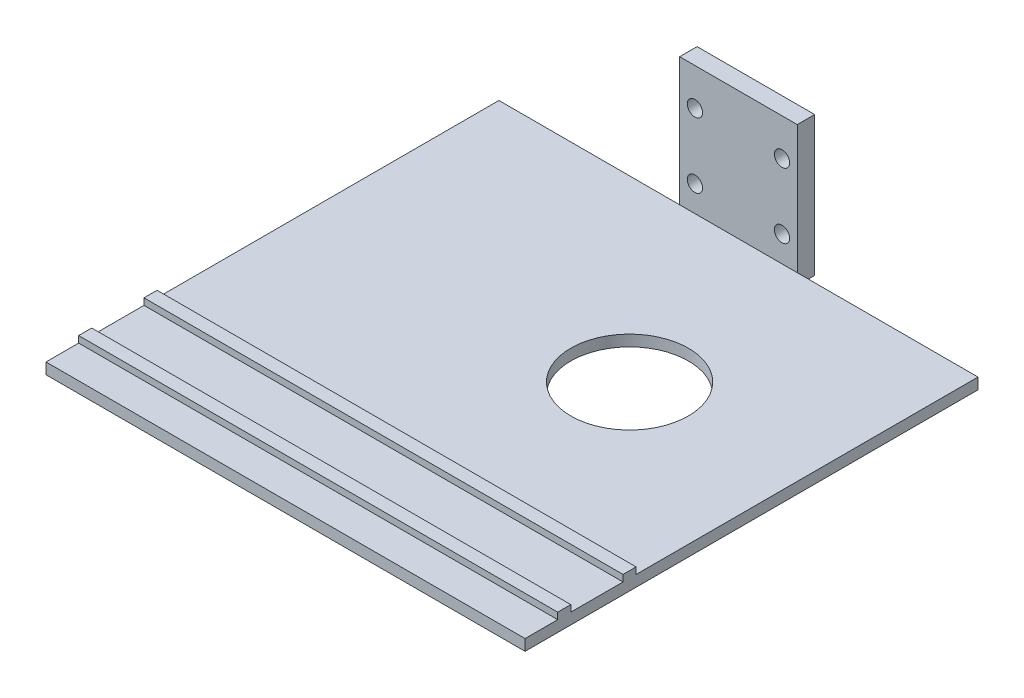
ISO-10303-21;
HEADER;
FILE_DESCRIPTION(('STEP AP214'),'2;1');
FILE_NAME('part.step','',(''),(''),'','','');
FILE_SCHEMA(('AUTOMOTIVE_DESIGN { 1 0 10303 214 1 1 1 1 }'));
ENDSEC;
DATA;
#1=APPLICATION_CONTEXT('core data for automotive mechanical design processes');
#2=APPLICATION_PROTOCOL_DEFINITION('international standard','automotive_design',2000,#1);
#3=PRODUCT_CONTEXT('',#1,'mechanical');
#4=PRODUCT('Part','Part','',(#3));
#5=PRODUCT_RELATED_PRODUCT_CATEGORY('part','',(#4));
#6=PRODUCT_DEFINITION_FORMATION('','',#4);
#7=PRODUCT_DEFINITION_CONTEXT('part definition',#1,'design');
#8=PRODUCT_DEFINITION('design','',#6,#7);
#9=PRODUCT_DEFINITION_SHAPE('','',#8);
#10=(LENGTH_UNIT() NAMED_UNIT(*) SI_UNIT(.MILLI.,.METRE.));
#11=(NAMED_UNIT(*) PLANE_ANGLE_UNIT() SI_UNIT($,.RADIAN.));
#12=(NAMED_UNIT(*) SI_UNIT($,.STERADIAN.) SOLID_ANGLE_UNIT());
#13=UNCERTAINTY_MEASURE_WITH_UNIT(LENGTH_MEASURE(1.E-05),#10,'distance_accuracy_value','');
#14=(GEOMETRIC_REPRESENTATION_CONTEXT(3) GLOBAL_UNCERTAINTY_ASSIGNED_CONTEXT((#13)) GLOBAL_UNIT_ASSIGNED_CONTEXT((#10,
#11,#12)) REPRESENTATION_CONTEXT('',''));
#15=CARTESIAN_POINT('',(0.,0.,0.));
#16=DIRECTION('',(0.,0.,1.));
#17=DIRECTION('',(1.,0.,0.));
#18=AXIS2_PLACEMENT_3D('',#15,#16,#17);
#19=CARTESIAN_POINT('',(-41.5,-33.4507406443201,4.));
#20=DIRECTION('',(0.,1.,0.));
#21=DIRECTION('',(0.,0.,1.));
#22=AXIS2_PLACEMENT_3D('',#19,#20,#21);
#23=PLANE('',#22);
#24=DIRECTION('',(-1.,0.,0.));
#25=VECTOR('',#24,1.);
#26=CARTESIAN_POINT('',(68.5,-33.4507406443201,97.5));
#27=LINE('',#26,#25);
#28=CARTESIAN_POINT('',(68.5,-33.4507406443201,97.5));
#29=VERTEX_POINT('',#28);
#30=CARTESIAN_POINT('',(-41.5,-33.4507406443201,97.5));
#31=VERTEX_POINT('',#30);
#32=EDGE_CURVE('E259',#29,#31,#27,.T.);
#33=ORIENTED_EDGE('',*,*,#32,.F.);
#34=DIRECTION('',(0.,0.,1.));
#35=VECTOR('',#34,1.);
#36=CARTESIAN_POINT('',(68.5,-33.45074064432,4.));
#37=LINE('',#36,#35);
#38=CARTESIAN_POINT('',(68.5,-33.4507406443201,85.5));
#39=VERTEX_POINT('',#38);
#40=EDGE_CURVE('E348',#39,#29,#37,.T.);
#41=ORIENTED_EDGE('',*,*,#40,.F.);
#42=DIRECTION('',(-1.,0.,0.));
#43=VECTOR('',#42,1.);
#44=CARTESIAN_POINT('',(68.5,-33.4507406443201,85.5));
#45=LINE('',#44,#43);
#46=CARTESIAN_POINT('',(-41.5,-33.4507406443201,85.5));
#47=VERTEX_POINT('',#46);
#48=EDGE_CURVE('E337',#39,#47,#45,.T.);
#49=ORIENTED_EDGE('',*,*,#48,.T.);
#50=DIRECTION('',(0.,0.,1.));
#51=VECTOR('',#50,1.);
#52=CARTESIAN_POINT('',(-41.5,-33.4507406443201,4.));
#53=LINE('',#52,#51);
#54=EDGE_CURVE('E270',#47,#31,#53,.T.);
#55=ORIENTED_EDGE('',*,*,#54,.T.);
#56=EDGE_LOOP('',(#33,#41,#49,#55));
#57=FACE_BOUND('',#56,.T.);
#58=ADVANCED_FACE('F33',(#57),#23,.T.);
#59=CARTESIAN_POINT('',(29.5,-33.4507406443201,45.));
#60=DIRECTION('',(0.,1.,0.));
#61=DIRECTION('',(0.,0.,1.));
#62=AXIS2_PLACEMENT_3D('',#59,#60,#61);
#63=CIRCLE('',#62,13.5);
#64=CARTESIAN_POINT('',(29.5,-33.4507406443201,58.5));
#65=VERTEX_POINT('',#64);
#66=EDGE_CURVE('E386',#65,#65,#63,.T.);
#67=ORIENTED_EDGE('',*,*,#66,.F.);
#68=EDGE_LOOP('',(#67));
#69=FACE_BOUND('',#68,.T.);
#70=DIRECTION('',(-1.,0.,0.));
#71=VECTOR('',#70,1.);
#72=CARTESIAN_POINT('',(68.5,-33.4507406443201,82.5));
#73=LINE('',#72,#71);
#74=CARTESIAN_POINT('',(68.5,-33.4507406443201,82.5));
#75=VERTEX_POINT('',#74);
#76=CARTESIAN_POINT('',(-41.5,-33.4507406443201,82.5));
#77=VERTEX_POINT('',#76);
#78=EDGE_CURVE('E340',#75,#77,#73,.T.);
#79=ORIENTED_EDGE('',*,*,#78,.F.);
#80=CARTESIAN_POINT('',(68.5,-33.45074064432,4.));
#81=VERTEX_POINT('',#80);
#82=EDGE_CURVE('E344',#81,#75,#37,.T.);
#83=ORIENTED_EDGE('',*,*,#82,.F.);
#84=DIRECTION('',(1.,0.,0.));
#85=VECTOR('',#84,1.);
#86=CARTESIAN_POINT('',(-41.5,-33.4507406443201,4.));
#87=LINE('',#86,#85);
#88=CARTESIAN_POINT('',(27.,-33.45074064432,4.));
#89=VERTEX_POINT('',#88);
#90=EDGE_CURVE('E45',#89,#81,#87,.T.);
#91=ORIENTED_EDGE('',*,*,#90,.F.);
#92=CARTESIAN_POINT('',(0.,-33.45074064432,4.));
#93=VERTEX_POINT('',#92);
#94=EDGE_CURVE('E11',#93,#89,#87,.T.);
#95=ORIENTED_EDGE('',*,*,#94,.F.);
#96=CARTESIAN_POINT('',(-41.5,-33.4507406443201,4.));
#97=VERTEX_POINT('',#96);
#98=EDGE_CURVE('E44',#97,#93,#87,.T.);
#99=ORIENTED_EDGE('',*,*,#98,.F.);
#100=EDGE_CURVE('E273',#97,#77,#53,.T.);
#101=ORIENTED_EDGE('',*,*,#100,.T.);
#102=EDGE_LOOP('',(#79,#83,#91,#95,#99,#101));
#103=FACE_BOUND('',#102,.T.);
#104=ADVANCED_FACE('F223',(#69,#103),#23,.T.);
#105=CARTESIAN_POINT('',(0.,0.,4.));
#106=DIRECTION('',(0.,0.,1.));
#107=DIRECTION('',(1.,0.,0.));
#108=AXIS2_PLACEMENT_3D('',#105,#106,#107);
#109=PLANE('',#108);
#110=DIRECTION('',(1.,0.,0.));
#111=VECTOR('',#110,1.);
#112=CARTESIAN_POINT('',(0.,-4.,4.));
#113=LINE('',#112,#111);
#114=CARTESIAN_POINT('',(0.,-4.,4.));
#115=VERTEX_POINT('',#114);
#116=CARTESIAN_POINT('',(27.,-4.,4.));
#117=VERTEX_POINT('',#116);
#118=EDGE_CURVE('E163',#115,#117,#113,.T.);
#119=ORIENTED_EDGE('',*,*,#118,.F.);
#120=DIRECTION('',(0.,-1.,0.));
#121=VECTOR('',#120,1.);
#122=CARTESIAN_POINT('',(0.,0.,4.));
#123=LINE('',#122,#121);
#124=EDGE_CURVE('E171',#115,#93,#123,.T.);
#125=ORIENTED_EDGE('',*,*,#124,.T.);
#126=ORIENTED_EDGE('',*,*,#94,.T.);
#127=DIRECTION('',(0.,1.,0.));
#128=VECTOR('',#127,1.);
#129=CARTESIAN_POINT('',(27.,0.,4.));
#130=LINE('',#129,#128);
#131=EDGE_CURVE('E305',#89,#117,#130,.T.);
#132=ORIENTED_EDGE('',*,*,#131,.T.);
#133=EDGE_LOOP('',(#119,#125,#126,#132));
#134=FACE_BOUND('',#133,.T.);
#135=CARTESIAN_POINT('',(23.5,-27.5,4.));
#136=DIRECTION('',(0.,0.,1.));
#137=DIRECTION('',(1.,0.,0.));
#138=AXIS2_PLACEMENT_3D('',#135,#136,#137);
#139=CIRCLE('',#138,1.75);
#140=CARTESIAN_POINT('',(25.25,-27.5,4.));
#141=VERTEX_POINT('',#140);
#142=EDGE_CURVE('E300',#141,#141,#139,.T.);
#143=ORIENTED_EDGE('',*,*,#142,.F.);
#144=EDGE_LOOP('',(#143));
#145=FACE_BOUND('',#144,.T.);
#146=CARTESIAN_POINT('',(3.5,-12.5,4.));
#147=DIRECTION('',(0.,0.,1.));
#148=DIRECTION('',(1.,0.,0.));
#149=AXIS2_PLACEMENT_3D('',#146,#147,#148);
#150=CIRCLE('',#149,1.75);
#151=CARTESIAN_POINT('',(5.25,-12.5,4.));
#152=VERTEX_POINT('',#151);
#153=EDGE_CURVE('E299',#152,#152,#150,.T.);
#154=ORIENTED_EDGE('',*,*,#153,.F.);
#155=EDGE_LOOP('',(#154));
#156=FACE_BOUND('',#155,.T.);
#157=CARTESIAN_POINT('',(3.5,-27.5,4.));
#158=DIRECTION('',(0.,0.,1.));
#159=DIRECTION('',(1.,0.,0.));
#160=AXIS2_PLACEMENT_3D('',#157,#158,#159);
#161=CIRCLE('',#160,1.75);
#162=CARTESIAN_POINT('',(5.25000000000001,-27.5,4.));
#163=VERTEX_POINT('',#162);
#164=EDGE_CURVE('E290',#163,#163,#161,.T.);
#165=ORIENTED_EDGE('',*,*,#164,.F.);
#166=EDGE_LOOP('',(#165));
#167=FACE_BOUND('',#166,.T.);
#168=CARTESIAN_POINT('',(23.5,-12.5,4.));
#169=DIRECTION('',(0.,0.,1.));
#170=DIRECTION('',(1.,0.,0.));
#171=AXIS2_PLACEMENT_3D('',#168,#169,#170);
#172=CIRCLE('',#171,1.75);
#173=CARTESIAN_POINT('',(25.25,-12.5,4.));
#174=VERTEX_POINT('',#173);
#175=EDGE_CURVE('E196',#174,#174,#172,.T.);
#176=ORIENTED_EDGE('',*,*,#175,.F.);
#177=EDGE_LOOP('',(#176));
#178=FACE_BOUND('',#177,.T.);
#179=ADVANCED_FACE('F231',(#134,#145,#156,#167,#178),#109,.T.);
#180=CARTESIAN_POINT('',(0.,0.,4.));
#181=DIRECTION('',(1.,0.,0.));
#182=DIRECTION('',(0.,1.,0.));
#183=AXIS2_PLACEMENT_3D('',#180,#181,#182);
#184=PLANE('',#183);
#185=ORIENTED_EDGE('',*,*,#124,.F.);
#186=DIRECTION('',(0.,0.,1.));
#187=VECTOR('',#186,1.);
#188=CARTESIAN_POINT('',(0.,-4.,0.));
#189=LINE('',#188,#187);
#190=CARTESIAN_POINT('',(0.,-4.,0.));
#191=VERTEX_POINT('',#190);
#192=EDGE_CURVE('E157',#191,#115,#189,.T.);
#193=ORIENTED_EDGE('',*,*,#192,.F.);
#194=DIRECTION('',(0.,-1.,0.));
#195=VECTOR('',#194,1.);
#196=CARTESIAN_POINT('',(0.,0.,0.));
#197=LINE('',#196,#195);
#198=CARTESIAN_POINT('',(0.,-36.,0.));
#199=VERTEX_POINT('',#198);
#200=EDGE_CURVE('E168',#191,#199,#197,.T.);
#201=ORIENTED_EDGE('',*,*,#200,.T.);
#202=DIRECTION('',(0.,0.,-1.));
#203=VECTOR('',#202,1.);
#204=CARTESIAN_POINT('',(0.,-36.,4.));
#205=LINE('',#204,#203);
#206=CARTESIAN_POINT('',(0.,-36.,4.));
#207=VERTEX_POINT('',#206);
#208=EDGE_CURVE('E42',#207,#199,#205,.T.);
#209=ORIENTED_EDGE('',*,*,#208,.F.);
#210=EDGE_CURVE('E187',#93,#207,#123,.T.);
#211=ORIENTED_EDGE('',*,*,#210,.F.);
#212=EDGE_LOOP('',(#185,#193,#201,#209,#211));
#213=FACE_BOUND('',#212,.T.);
#214=ADVANCED_FACE('F35',(#213),#184,.F.);
#215=CARTESIAN_POINT('',(0.,-36.,4.));
#216=DIRECTION('',(0.,1.,0.));
#217=DIRECTION('',(0.,0.,1.));
#218=AXIS2_PLACEMENT_3D('',#215,#216,#217);
#219=PLANE('',#218);
#220=CARTESIAN_POINT('',(29.5,-36.,45.));
#221=DIRECTION('',(0.,1.,0.));
#222=DIRECTION('',(0.,0.,1.));
#223=AXIS2_PLACEMENT_3D('',#220,#221,#222);
#224=CIRCLE('',#223,13.5);
#225=CARTESIAN_POINT('',(29.5,-36.,58.5));
#226=VERTEX_POINT('',#225);
#227=EDGE_CURVE('E37',#226,#226,#224,.T.);
#228=ORIENTED_EDGE('',*,*,#227,.T.);
#229=EDGE_LOOP('',(#228));
#230=FACE_BOUND('',#229,.T.);
#231=DIRECTION('',(1.,0.,0.));
#232=VECTOR('',#231,1.);
#233=CARTESIAN_POINT('',(0.,-36.,0.));
#234=LINE('',#233,#232);
#235=CARTESIAN_POINT('',(27.,-36.,0.));
#236=VERTEX_POINT('',#235);
#237=EDGE_CURVE('E174',#199,#236,#234,.T.);
#238=ORIENTED_EDGE('',*,*,#237,.T.);
#239=DIRECTION('',(0.,0.,-1.));
#240=VECTOR('',#239,1.);
#241=CARTESIAN_POINT('',(27.,-36.,4.));
#242=LINE('',#241,#240);
#243=CARTESIAN_POINT('',(27.,-36.,4.));
#244=VERTEX_POINT('',#243);
#245=EDGE_CURVE('E188',#244,#236,#242,.T.);
#246=ORIENTED_EDGE('',*,*,#245,.F.);
#247=DIRECTION('',(1.,0.,0.));
#248=VECTOR('',#247,1.);
#249=CARTESIAN_POINT('',(-41.5,-36.,4.));
#250=LINE('',#249,#248);
#251=CARTESIAN_POINT('',(68.5,-36.,4.));
#252=VERTEX_POINT('',#251);
#253=EDGE_CURVE('E291',#244,#252,#250,.T.);
#254=ORIENTED_EDGE('',*,*,#253,.T.);
#255=DIRECTION('',(0.,0.,-1.));
#256=VECTOR('',#255,1.);
#257=CARTESIAN_POINT('',(68.5,-36.,4.));
#258=LINE('',#257,#256);
#259=CARTESIAN_POINT('',(68.5,-36.,108.));
#260=VERTEX_POINT('',#259);
#261=EDGE_CURVE('E276',#260,#252,#258,.T.);
#262=ORIENTED_EDGE('',*,*,#261,.F.);
#263=DIRECTION('',(1.,0.,0.));
#264=VECTOR('',#263,1.);
#265=CARTESIAN_POINT('',(-41.5,-36.,108.));
#266=LINE('',#265,#264);
#267=CARTESIAN_POINT('',(-41.5,-36.,108.));
#268=VERTEX_POINT('',#267);
#269=EDGE_CURVE('E292',#268,#260,#266,.T.);
#270=ORIENTED_EDGE('',*,*,#269,.F.);
#271=DIRECTION('',(0.,0.,-1.));
#272=VECTOR('',#271,1.);
#273=CARTESIAN_POINT('',(-41.5,-36.,4.));
#274=LINE('',#273,#272);
#275=CARTESIAN_POINT('',(-41.5,-36.,4.));
#276=VERTEX_POINT('',#275);
#277=EDGE_CURVE('E283',#268,#276,#274,.T.);
#278=ORIENTED_EDGE('',*,*,#277,.T.);
#279=EDGE_CURVE('E287',#276,#207,#250,.T.);
#280=ORIENTED_EDGE('',*,*,#279,.T.);
#281=ORIENTED_EDGE('',*,*,#208,.T.);
#282=EDGE_LOOP('',(#238,#246,#254,#262,#270,#278,#280,#281));
#283=FACE_BOUND('',#282,.T.);
#284=ADVANCED_FACE('F311',(#230,#283),#219,.F.);
#285=CARTESIAN_POINT('',(27.,0.,4.));
#286=DIRECTION('',(-1.,0.,0.));
#287=DIRECTION('',(0.,-1.,0.));
#288=AXIS2_PLACEMENT_3D('',#285,#286,#287);
#289=PLANE('',#288);
#290=DIRECTION('',(0.,1.,0.));
#291=VECTOR('',#290,1.);
#292=CARTESIAN_POINT('',(27.,0.,0.));
#293=LINE('',#292,#291);
#294=CARTESIAN_POINT('',(27.,-4.,0.));
#295=VERTEX_POINT('',#294);
#296=EDGE_CURVE('E178',#236,#295,#293,.T.);
#297=ORIENTED_EDGE('',*,*,#296,.T.);
#298=DIRECTION('',(0.,0.,1.));
#299=VECTOR('',#298,1.);
#300=CARTESIAN_POINT('',(27.,-4.,0.));
#301=LINE('',#300,#299);
#302=EDGE_CURVE('E52',#295,#117,#301,.T.);
#303=ORIENTED_EDGE('',*,*,#302,.T.);
#304=ORIENTED_EDGE('',*,*,#131,.F.);
#305=EDGE_CURVE('E183',#244,#89,#130,.T.);
#306=ORIENTED_EDGE('',*,*,#305,.F.);
#307=ORIENTED_EDGE('',*,*,#245,.T.);
#308=EDGE_LOOP('',(#297,#303,#304,#306,#307));
#309=FACE_BOUND('',#308,.T.);
#310=ADVANCED_FACE('F472',(#309),#289,.F.);
#311=CARTESIAN_POINT('',(0.,0.,0.));
#312=DIRECTION('',(0.,0.,1.));
#313=DIRECTION('',(1.,0.,0.));
#314=AXIS2_PLACEMENT_3D('',#311,#312,#313);
#315=PLANE('',#314);
#316=CARTESIAN_POINT('',(23.5,-27.5,0.));
#317=DIRECTION('',(0.,0.,1.));
#318=DIRECTION('',(1.,0.,0.));
#319=AXIS2_PLACEMENT_3D('',#316,#317,#318);
#320=CIRCLE('',#319,1.75);
#321=CARTESIAN_POINT('',(25.25,-27.5,0.));
#322=VERTEX_POINT('',#321);
#323=EDGE_CURVE('E176',#322,#322,#320,.T.);
#324=ORIENTED_EDGE('',*,*,#323,.T.);
#325=EDGE_LOOP('',(#324));
#326=FACE_BOUND('',#325,.T.);
#327=CARTESIAN_POINT('',(3.5,-12.5,0.));
#328=DIRECTION('',(0.,0.,1.));
#329=DIRECTION('',(1.,0.,0.));
#330=AXIS2_PLACEMENT_3D('',#327,#328,#329);
#331=CIRCLE('',#330,1.75);
#332=CARTESIAN_POINT('',(5.25,-12.5,0.));
#333=VERTEX_POINT('',#332);
#334=EDGE_CURVE('E181',#333,#333,#331,.T.);
#335=ORIENTED_EDGE('',*,*,#334,.T.);
#336=EDGE_LOOP('',(#335));
#337=FACE_BOUND('',#336,.T.);
#338=CARTESIAN_POINT('',(3.5,-27.5,0.));
#339=DIRECTION('',(0.,0.,1.));
#340=DIRECTION('',(1.,0.,0.));
#341=AXIS2_PLACEMENT_3D('',#338,#339,#340);
#342=CIRCLE('',#341,1.75);
#343=CARTESIAN_POINT('',(5.25000000000001,-27.5,0.));
#344=VERTEX_POINT('',#343);
#345=EDGE_CURVE('E195',#344,#344,#342,.T.);
#346=ORIENTED_EDGE('',*,*,#345,.T.);
#347=EDGE_LOOP('',(#346));
#348=FACE_BOUND('',#347,.T.);
#349=CARTESIAN_POINT('',(23.5,-12.5,0.));
#350=DIRECTION('',(0.,0.,1.));
#351=DIRECTION('',(1.,0.,0.));
#352=AXIS2_PLACEMENT_3D('',#349,#350,#351);
#353=CIRCLE('',#352,1.75);
#354=CARTESIAN_POINT('',(25.25,-12.5,0.));
#355=VERTEX_POINT('',#354);
#356=EDGE_CURVE('E192',#355,#355,#353,.T.);
#357=ORIENTED_EDGE('',*,*,#356,.T.);
#358=EDGE_LOOP('',(#357));
#359=FACE_BOUND('',#358,.T.);
#360=ORIENTED_EDGE('',*,*,#200,.F.);
#361=DIRECTION('',(1.,0.,0.));
#362=VECTOR('',#361,1.);
#363=CARTESIAN_POINT('',(0.,-4.,0.));
#364=LINE('',#363,#362);
#365=EDGE_CURVE('E154',#191,#295,#364,.T.);
#366=ORIENTED_EDGE('',*,*,#365,.T.);
#367=ORIENTED_EDGE('',*,*,#296,.F.);
#368=ORIENTED_EDGE('',*,*,#237,.F.);
#369=EDGE_LOOP('',(#360,#366,#367,#368));
#370=FACE_BOUND('',#369,.T.);
#371=ADVANCED_FACE('F173',(#326,#337,#348,#359,#370),#315,.F.);
#372=CARTESIAN_POINT('',(23.5,-12.5,-6.));
#373=DIRECTION('',(0.,0.,1.));
#374=DIRECTION('',(1.,0.,0.));
#375=AXIS2_PLACEMENT_3D('',#372,#373,#374);
#376=CYLINDRICAL_SURFACE('',#375,1.75);
#377=ORIENTED_EDGE('',*,*,#175,.T.);
#378=EDGE_LOOP('',(#377));
#379=FACE_BOUND('',#378,.T.);
#380=ORIENTED_EDGE('',*,*,#356,.F.);
#381=EDGE_LOOP('',(#380));
#382=FACE_BOUND('',#381,.T.);
#383=ADVANCED_FACE('F217',(#379,#382),#376,.F.);
#384=CARTESIAN_POINT('',(3.5,-27.5,-6.));
#385=DIRECTION('',(0.,0.,1.));
#386=DIRECTION('',(1.,0.,0.));
#387=AXIS2_PLACEMENT_3D('',#384,#385,#386);
#388=CYLINDRICAL_SURFACE('',#387,1.75);
#389=ORIENTED_EDGE('',*,*,#164,.T.);
#390=EDGE_LOOP('',(#389));
#391=FACE_BOUND('',#390,.T.);
#392=ORIENTED_EDGE('',*,*,#345,.F.);
#393=EDGE_LOOP('',(#392));
#394=FACE_BOUND('',#393,.T.);
#395=ADVANCED_FACE('F207',(#391,#394),#388,.F.);
#396=CARTESIAN_POINT('',(3.5,-12.5,-6.));
#397=DIRECTION('',(0.,0.,1.));
#398=DIRECTION('',(1.,0.,0.));
#399=AXIS2_PLACEMENT_3D('',#396,#397,#398);
#400=CYLINDRICAL_SURFACE('',#399,1.75);
#401=ORIENTED_EDGE('',*,*,#153,.T.);
#402=EDGE_LOOP('',(#401));
#403=FACE_BOUND('',#402,.T.);
#404=ORIENTED_EDGE('',*,*,#334,.F.);
#405=EDGE_LOOP('',(#404));
#406=FACE_BOUND('',#405,.T.);
#407=ADVANCED_FACE('F204',(#403,#406),#400,.F.);
#408=CARTESIAN_POINT('',(23.5,-27.5,-6.));
#409=DIRECTION('',(0.,0.,1.));
#410=DIRECTION('',(1.,0.,0.));
#411=AXIS2_PLACEMENT_3D('',#408,#409,#410);
#412=CYLINDRICAL_SURFACE('',#411,1.75);
#413=ORIENTED_EDGE('',*,*,#142,.T.);
#414=EDGE_LOOP('',(#413));
#415=FACE_BOUND('',#414,.T.);
#416=ORIENTED_EDGE('',*,*,#323,.F.);
#417=EDGE_LOOP('',(#416));
#418=FACE_BOUND('',#417,.T.);
#419=ADVANCED_FACE('F206',(#415,#418),#412,.F.);
#420=CARTESIAN_POINT('',(-41.5,-36.,4.));
#421=DIRECTION('',(0.,0.,-1.));
#422=DIRECTION('',(-1.,0.,0.));
#423=AXIS2_PLACEMENT_3D('',#420,#421,#422);
#424=PLANE('',#423);
#425=ORIENTED_EDGE('',*,*,#98,.T.);
#426=ORIENTED_EDGE('',*,*,#210,.T.);
#427=ORIENTED_EDGE('',*,*,#279,.F.);
#428=DIRECTION('',(0.,1.,0.));
#429=VECTOR('',#428,1.);
#430=CARTESIAN_POINT('',(-41.5,-36.,4.));
#431=LINE('',#430,#429);
#432=EDGE_CURVE('E271',#276,#97,#431,.T.);
#433=ORIENTED_EDGE('',*,*,#432,.T.);
#434=EDGE_LOOP('',(#425,#426,#427,#433));
#435=FACE_BOUND('',#434,.T.);
#436=ADVANCED_FACE('F214',(#435),#424,.T.);
#437=ORIENTED_EDGE('',*,*,#253,.F.);
#438=ORIENTED_EDGE('',*,*,#305,.T.);
#439=ORIENTED_EDGE('',*,*,#90,.T.);
#440=DIRECTION('',(0.,1.,0.));
#441=VECTOR('',#440,1.);
#442=CARTESIAN_POINT('',(68.5,-36.,4.));
#443=LINE('',#442,#441);
#444=EDGE_CURVE('E334',#252,#81,#443,.T.);
#445=ORIENTED_EDGE('',*,*,#444,.F.);
#446=EDGE_LOOP('',(#437,#438,#439,#445));
#447=FACE_BOUND('',#446,.T.);
#448=ADVANCED_FACE('F247',(#447),#424,.T.);
#449=CARTESIAN_POINT('',(-41.5,-36.,108.));
#450=DIRECTION('',(0.,0.,1.));
#451=DIRECTION('',(0.,-1.,0.));
#452=AXIS2_PLACEMENT_3D('',#449,#450,#451);
#453=PLANE('',#452);
#454=ORIENTED_EDGE('',*,*,#269,.T.);
#455=DIRECTION('',(0.,-1.,0.));
#456=VECTOR('',#455,1.);
#457=CARTESIAN_POINT('',(68.5,-36.,108.));
#458=LINE('',#457,#456);
#459=CARTESIAN_POINT('',(68.5,-33.4507406443201,108.));
#460=VERTEX_POINT('',#459);
#461=EDGE_CURVE('E347',#460,#260,#458,.T.);
#462=ORIENTED_EDGE('',*,*,#461,.F.);
#463=DIRECTION('',(1.,0.,0.));
#464=VECTOR('',#463,1.);
#465=CARTESIAN_POINT('',(-41.5,-33.4507406443201,108.));
#466=LINE('',#465,#464);
#467=CARTESIAN_POINT('',(-41.5,-33.4507406443201,108.));
#468=VERTEX_POINT('',#467);
#469=EDGE_CURVE('E294',#468,#460,#466,.T.);
#470=ORIENTED_EDGE('',*,*,#469,.F.);
#471=DIRECTION('',(0.,-1.,0.));
#472=VECTOR('',#471,1.);
#473=CARTESIAN_POINT('',(-41.5,-36.,108.));
#474=LINE('',#473,#472);
#475=EDGE_CURVE('E269',#468,#268,#474,.T.);
#476=ORIENTED_EDGE('',*,*,#475,.T.);
#477=EDGE_LOOP('',(#454,#462,#470,#476));
#478=FACE_BOUND('',#477,.T.);
#479=ADVANCED_FACE('F238',(#478),#453,.T.);
#480=DIRECTION('',(-1.,0.,0.));
#481=VECTOR('',#480,1.);
#482=CARTESIAN_POINT('',(68.5,-33.4507406443201,100.5));
#483=LINE('',#482,#481);
#484=CARTESIAN_POINT('',(68.5,-33.4507406443201,100.5));
#485=VERTEX_POINT('',#484);
#486=CARTESIAN_POINT('',(-41.5,-33.4507406443201,100.5));
#487=VERTEX_POINT('',#486);
#488=EDGE_CURVE('E251',#485,#487,#483,.T.);
#489=ORIENTED_EDGE('',*,*,#488,.T.);
#490=EDGE_CURVE('E254',#487,#468,#53,.T.);
#491=ORIENTED_EDGE('',*,*,#490,.T.);
#492=ORIENTED_EDGE('',*,*,#469,.T.);
#493=EDGE_CURVE('E256',#485,#460,#37,.T.);
#494=ORIENTED_EDGE('',*,*,#493,.F.);
#495=EDGE_LOOP('',(#489,#491,#492,#494));
#496=FACE_BOUND('',#495,.T.);
#497=ADVANCED_FACE('F226',(#496),#23,.T.);
#498=CARTESIAN_POINT('',(-41.5,0.,0.));
#499=DIRECTION('',(1.,0.,0.));
#500=DIRECTION('',(0.,0.,-1.));
#501=AXIS2_PLACEMENT_3D('',#498,#499,#500);
#502=PLANE('',#501);
#503=ORIENTED_EDGE('',*,*,#432,.F.);
#504=ORIENTED_EDGE('',*,*,#277,.F.);
#505=ORIENTED_EDGE('',*,*,#475,.F.);
#506=ORIENTED_EDGE('',*,*,#490,.F.);
#507=DIRECTION('',(0.,1.,0.));
#508=VECTOR('',#507,1.);
#509=CARTESIAN_POINT('',(-41.5,-33.4507406443201,100.5));
#510=LINE('',#509,#508);
#511=CARTESIAN_POINT('',(-41.5,-31.95074064432,100.5));
#512=VERTEX_POINT('',#511);
#513=EDGE_CURVE('E265',#487,#512,#510,.T.);
#514=ORIENTED_EDGE('',*,*,#513,.T.);
#515=DIRECTION('',(0.,0.,-1.));
#516=VECTOR('',#515,1.);
#517=CARTESIAN_POINT('',(-41.5,-31.95074064432,97.5));
#518=LINE('',#517,#516);
#519=CARTESIAN_POINT('',(-41.5,-31.95074064432,97.5));
#520=VERTEX_POINT('',#519);
#521=EDGE_CURVE('E373',#512,#520,#518,.T.);
#522=ORIENTED_EDGE('',*,*,#521,.T.);
#523=DIRECTION('',(0.,-1.,0.));
#524=VECTOR('',#523,1.);
#525=CARTESIAN_POINT('',(-41.5,-33.4507406443201,97.5));
#526=LINE('',#525,#524);
#527=EDGE_CURVE('E377',#520,#31,#526,.T.);
#528=ORIENTED_EDGE('',*,*,#527,.T.);
#529=ORIENTED_EDGE('',*,*,#54,.F.);
#530=DIRECTION('',(0.,1.,0.));
#531=VECTOR('',#530,1.);
#532=CARTESIAN_POINT('',(-41.5,-33.4507406443201,85.5));
#533=LINE('',#532,#531);
#534=CARTESIAN_POINT('',(-41.5,-31.9507406443201,85.5));
#535=VERTEX_POINT('',#534);
#536=EDGE_CURVE('E321',#47,#535,#533,.T.);
#537=ORIENTED_EDGE('',*,*,#536,.T.);
#538=DIRECTION('',(0.,0.,-1.));
#539=VECTOR('',#538,1.);
#540=CARTESIAN_POINT('',(-41.5,-31.9507406443201,82.5));
#541=LINE('',#540,#539);
#542=CARTESIAN_POINT('',(-41.5,-31.9507406443201,82.5));
#543=VERTEX_POINT('',#542);
#544=EDGE_CURVE('E319',#535,#543,#541,.T.);
#545=ORIENTED_EDGE('',*,*,#544,.T.);
#546=DIRECTION('',(0.,-1.,0.));
#547=VECTOR('',#546,1.);
#548=CARTESIAN_POINT('',(-41.5,-33.4507406443201,82.5));
#549=LINE('',#548,#547);
#550=EDGE_CURVE('E316',#543,#77,#549,.T.);
#551=ORIENTED_EDGE('',*,*,#550,.T.);
#552=ORIENTED_EDGE('',*,*,#100,.F.);
#553=EDGE_LOOP('',(#503,#504,#505,#506,#514,#522,#528,#529,#537,#545,#551,#552));
#554=FACE_BOUND('',#553,.T.);
#555=ADVANCED_FACE('F237',(#554),#502,.F.);
#556=CARTESIAN_POINT('',(68.5,0.,0.));
#557=DIRECTION('',(1.,0.,0.));
#558=DIRECTION('',(0.,0.,-1.));
#559=AXIS2_PLACEMENT_3D('',#556,#557,#558);
#560=PLANE('',#559);
#561=ORIENTED_EDGE('',*,*,#444,.T.);
#562=ORIENTED_EDGE('',*,*,#82,.T.);
#563=DIRECTION('',(0.,-1.,0.));
#564=VECTOR('',#563,1.);
#565=CARTESIAN_POINT('',(68.5,-33.4507406443201,82.5));
#566=LINE('',#565,#564);
#567=CARTESIAN_POINT('',(68.5,-31.9507406443201,82.5));
#568=VERTEX_POINT('',#567);
#569=EDGE_CURVE('E331',#568,#75,#566,.T.);
#570=ORIENTED_EDGE('',*,*,#569,.F.);
#571=DIRECTION('',(0.,0.,-1.));
#572=VECTOR('',#571,1.);
#573=CARTESIAN_POINT('',(68.5,-31.9507406443201,82.5));
#574=LINE('',#573,#572);
#575=CARTESIAN_POINT('',(68.5,-31.9507406443201,85.5));
#576=VERTEX_POINT('',#575);
#577=EDGE_CURVE('E327',#576,#568,#574,.T.);
#578=ORIENTED_EDGE('',*,*,#577,.F.);
#579=DIRECTION('',(0.,1.,0.));
#580=VECTOR('',#579,1.);
#581=CARTESIAN_POINT('',(68.5,-33.4507406443201,85.5));
#582=LINE('',#581,#580);
#583=EDGE_CURVE('E362',#39,#576,#582,.T.);
#584=ORIENTED_EDGE('',*,*,#583,.F.);
#585=ORIENTED_EDGE('',*,*,#40,.T.);
#586=DIRECTION('',(0.,-1.,0.));
#587=VECTOR('',#586,1.);
#588=CARTESIAN_POINT('',(68.5,-33.4507406443201,97.5));
#589=LINE('',#588,#587);
#590=CARTESIAN_POINT('',(68.5,-31.95074064432,97.5));
#591=VERTEX_POINT('',#590);
#592=EDGE_CURVE('E375',#591,#29,#589,.T.);
#593=ORIENTED_EDGE('',*,*,#592,.F.);
#594=DIRECTION('',(0.,0.,-1.));
#595=VECTOR('',#594,1.);
#596=CARTESIAN_POINT('',(68.5,-31.95074064432,97.5));
#597=LINE('',#596,#595);
#598=CARTESIAN_POINT('',(68.5,-31.95074064432,100.5));
#599=VERTEX_POINT('',#598);
#600=EDGE_CURVE('E370',#599,#591,#597,.T.);
#601=ORIENTED_EDGE('',*,*,#600,.F.);
#602=DIRECTION('',(0.,1.,0.));
#603=VECTOR('',#602,1.);
#604=CARTESIAN_POINT('',(68.5,-33.4507406443201,100.5));
#605=LINE('',#604,#603);
#606=EDGE_CURVE('E60',#485,#599,#605,.T.);
#607=ORIENTED_EDGE('',*,*,#606,.F.);
#608=ORIENTED_EDGE('',*,*,#493,.T.);
#609=ORIENTED_EDGE('',*,*,#461,.T.);
#610=ORIENTED_EDGE('',*,*,#261,.T.);
#611=EDGE_LOOP('',(#561,#562,#570,#578,#584,#585,#593,#601,#607,#608,#609,#610));
#612=FACE_BOUND('',#611,.T.);
#613=ADVANCED_FACE('F244',(#612),#560,.T.);
#614=CARTESIAN_POINT('',(68.5,-33.4507406443201,82.5));
#615=DIRECTION('',(0.,0.,-1.));
#616=DIRECTION('',(-1.,0.,0.));
#617=AXIS2_PLACEMENT_3D('',#614,#615,#616);
#618=PLANE('',#617);
#619=ORIENTED_EDGE('',*,*,#550,.F.);
#620=DIRECTION('',(-1.,0.,0.));
#621=VECTOR('',#620,1.);
#622=CARTESIAN_POINT('',(68.5,-31.9507406443201,82.5));
#623=LINE('',#622,#621);
#624=EDGE_CURVE('E332',#568,#543,#623,.T.);
#625=ORIENTED_EDGE('',*,*,#624,.F.);
#626=ORIENTED_EDGE('',*,*,#569,.T.);
#627=ORIENTED_EDGE('',*,*,#78,.T.);
#628=EDGE_LOOP('',(#619,#625,#626,#627));
#629=FACE_BOUND('',#628,.T.);
#630=ADVANCED_FACE('F416',(#629),#618,.T.);
#631=CARTESIAN_POINT('',(68.5,-31.9507406443201,82.5));
#632=DIRECTION('',(0.,1.,0.));
#633=DIRECTION('',(0.,0.,1.));
#634=AXIS2_PLACEMENT_3D('',#631,#632,#633);
#635=PLANE('',#634);
#636=ORIENTED_EDGE('',*,*,#544,.F.);
#637=DIRECTION('',(-1.,0.,0.));
#638=VECTOR('',#637,1.);
#639=CARTESIAN_POINT('',(68.5,-31.9507406443201,85.5));
#640=LINE('',#639,#638);
#641=EDGE_CURVE('E335',#576,#535,#640,.T.);
#642=ORIENTED_EDGE('',*,*,#641,.F.);
#643=ORIENTED_EDGE('',*,*,#577,.T.);
#644=ORIENTED_EDGE('',*,*,#624,.T.);
#645=EDGE_LOOP('',(#636,#642,#643,#644));
#646=FACE_BOUND('',#645,.T.);
#647=ADVANCED_FACE('F365',(#646),#635,.T.);
#648=CARTESIAN_POINT('',(68.5,-33.4507406443201,85.5));
#649=DIRECTION('',(0.,0.,1.));
#650=DIRECTION('',(1.,0.,0.));
#651=AXIS2_PLACEMENT_3D('',#648,#649,#650);
#652=PLANE('',#651);
#653=ORIENTED_EDGE('',*,*,#536,.F.);
#654=ORIENTED_EDGE('',*,*,#48,.F.);
#655=ORIENTED_EDGE('',*,*,#583,.T.);
#656=ORIENTED_EDGE('',*,*,#641,.T.);
#657=EDGE_LOOP('',(#653,#654,#655,#656));
#658=FACE_BOUND('',#657,.T.);
#659=ADVANCED_FACE('F412',(#658),#652,.T.);
#660=CARTESIAN_POINT('',(68.5,-33.4507406443201,97.5));
#661=DIRECTION('',(0.,0.,-1.));
#662=DIRECTION('',(-1.,0.,0.));
#663=AXIS2_PLACEMENT_3D('',#660,#661,#662);
#664=PLANE('',#663);
#665=ORIENTED_EDGE('',*,*,#527,.F.);
#666=DIRECTION('',(-1.,0.,0.));
#667=VECTOR('',#666,1.);
#668=CARTESIAN_POINT('',(68.5,-31.95074064432,97.5));
#669=LINE('',#668,#667);
#670=EDGE_CURVE('E322',#591,#520,#669,.T.);
#671=ORIENTED_EDGE('',*,*,#670,.F.);
#672=ORIENTED_EDGE('',*,*,#592,.T.);
#673=ORIENTED_EDGE('',*,*,#32,.T.);
#674=EDGE_LOOP('',(#665,#671,#672,#673));
#675=FACE_BOUND('',#674,.T.);
#676=ADVANCED_FACE('F406',(#675),#664,.T.);
#677=CARTESIAN_POINT('',(68.5,-31.95074064432,97.5));
#678=DIRECTION('',(0.,1.,0.));
#679=DIRECTION('',(0.,0.,1.));
#680=AXIS2_PLACEMENT_3D('',#677,#678,#679);
#681=PLANE('',#680);
#682=ORIENTED_EDGE('',*,*,#521,.F.);
#683=DIRECTION('',(-1.,0.,0.));
#684=VECTOR('',#683,1.);
#685=CARTESIAN_POINT('',(68.5,-31.95074064432,100.5));
#686=LINE('',#685,#684);
#687=EDGE_CURVE('E258',#599,#512,#686,.T.);
#688=ORIENTED_EDGE('',*,*,#687,.F.);
#689=ORIENTED_EDGE('',*,*,#600,.T.);
#690=ORIENTED_EDGE('',*,*,#670,.T.);
#691=EDGE_LOOP('',(#682,#688,#689,#690));
#692=FACE_BOUND('',#691,.T.);
#693=ADVANCED_FACE('F403',(#692),#681,.T.);
#694=CARTESIAN_POINT('',(68.5,-33.4507406443201,100.5));
#695=DIRECTION('',(0.,0.,1.));
#696=DIRECTION('',(1.,0.,0.));
#697=AXIS2_PLACEMENT_3D('',#694,#695,#696);
#698=PLANE('',#697);
#699=ORIENTED_EDGE('',*,*,#513,.F.);
#700=ORIENTED_EDGE('',*,*,#488,.F.);
#701=ORIENTED_EDGE('',*,*,#606,.T.);
#702=ORIENTED_EDGE('',*,*,#687,.T.);
#703=EDGE_LOOP('',(#699,#700,#701,#702));
#704=FACE_BOUND('',#703,.T.);
#705=ADVANCED_FACE('F400',(#704),#698,.T.);
#706=CARTESIAN_POINT('',(0.,-4.,0.));
#707=DIRECTION('',(0.,-1.,0.));
#708=DIRECTION('',(0.,0.,-1.));
#709=AXIS2_PLACEMENT_3D('',#706,#707,#708);
#710=PLANE('',#709);
#711=ORIENTED_EDGE('',*,*,#118,.T.);
#712=ORIENTED_EDGE('',*,*,#302,.F.);
#713=ORIENTED_EDGE('',*,*,#365,.F.);
#714=ORIENTED_EDGE('',*,*,#192,.T.);
#715=EDGE_LOOP('',(#711,#712,#713,#714));
#716=FACE_BOUND('',#715,.T.);
#717=ADVANCED_FACE('F156',(#716),#710,.F.);
#718=CARTESIAN_POINT('',(29.5,-43.4507406443201,45.));
#719=DIRECTION('',(0.,1.,0.));
#720=DIRECTION('',(0.,0.,1.));
#721=AXIS2_PLACEMENT_3D('',#718,#719,#720);
#722=CYLINDRICAL_SURFACE('',#721,13.5);
#723=ORIENTED_EDGE('',*,*,#66,.T.);
#724=EDGE_LOOP('',(#723));
#725=FACE_BOUND('',#724,.T.);
#726=ORIENTED_EDGE('',*,*,#227,.F.);
#727=EDGE_LOOP('',(#726));
#728=FACE_BOUND('',#727,.T.);
#729=ADVANCED_FACE('F394',(#725,#728),#722,.F.);
#730=CLOSED_SHELL('',(#58,#104,#179,#214,#284,#310,#371,#383,#395,#407,#419,#436,#448,#479,#497,
#555,#613,#630,#647,#659,#676,#693,#705,#717,#729));
#731=MANIFOLD_SOLID_BREP('B2',#730);
#732=ADVANCED_BREP_SHAPE_REPRESENTATION('',(#18,#731),#14);
#733=SHAPE_DEFINITION_REPRESENTATION(#9,#732);
ENDSEC;
END-ISO-10303-21;
